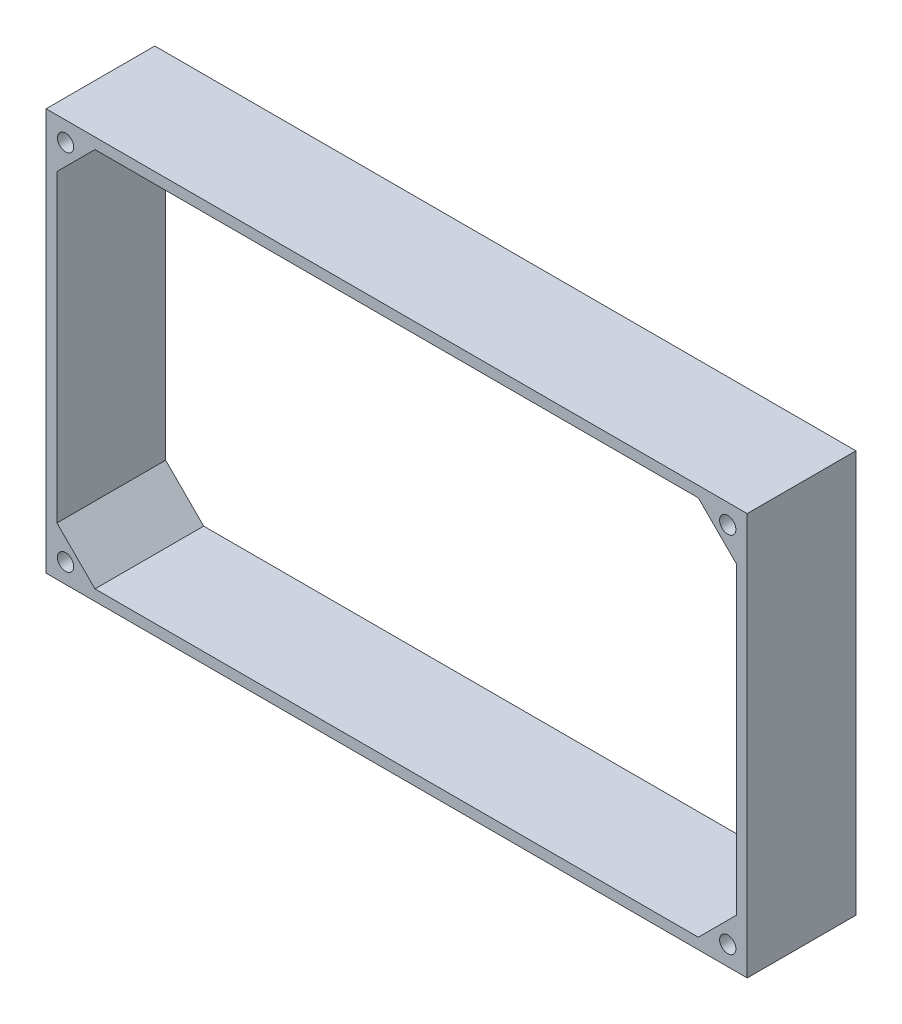
ISO-10303-21;
HEADER;
FILE_DESCRIPTION(('STEP AP214'),'2;1');
FILE_NAME('part.step','',(''),(''),'','','');
FILE_SCHEMA(('AUTOMOTIVE_DESIGN { 1 0 10303 214 1 1 1 1 }'));
ENDSEC;
DATA;
#1=APPLICATION_CONTEXT('core data for automotive mechanical design processes');
#2=APPLICATION_PROTOCOL_DEFINITION('international standard','automotive_design',2000,#1);
#3=PRODUCT_CONTEXT('',#1,'mechanical');
#4=PRODUCT('Part','Part','',(#3));
#5=PRODUCT_RELATED_PRODUCT_CATEGORY('part','',(#4));
#6=PRODUCT_DEFINITION_FORMATION('','',#4);
#7=PRODUCT_DEFINITION_CONTEXT('part definition',#1,'design');
#8=PRODUCT_DEFINITION('design','',#6,#7);
#9=PRODUCT_DEFINITION_SHAPE('','',#8);
#10=(LENGTH_UNIT() NAMED_UNIT(*) SI_UNIT(.MILLI.,.METRE.));
#11=(NAMED_UNIT(*) PLANE_ANGLE_UNIT() SI_UNIT($,.RADIAN.));
#12=(NAMED_UNIT(*) SI_UNIT($,.STERADIAN.) SOLID_ANGLE_UNIT());
#13=UNCERTAINTY_MEASURE_WITH_UNIT(LENGTH_MEASURE(1.E-05),#10,'distance_accuracy_value','');
#14=(GEOMETRIC_REPRESENTATION_CONTEXT(3) GLOBAL_UNCERTAINTY_ASSIGNED_CONTEXT((#13)) GLOBAL_UNIT_ASSIGNED_CONTEXT((#10,
#11,#12)) REPRESENTATION_CONTEXT('',''));
#15=CARTESIAN_POINT('',(0.,0.,0.));
#16=DIRECTION('',(0.,0.,1.));
#17=DIRECTION('',(1.,0.,0.));
#18=AXIS2_PLACEMENT_3D('',#15,#16,#17);
#19=CARTESIAN_POINT('',(0.,74.,40.));
#20=DIRECTION('',(0.,1.,0.));
#21=DIRECTION('',(-1.,0.,0.));
#22=AXIS2_PLACEMENT_3D('',#19,#20,#21);
#23=PLANE('',#22);
#24=DIRECTION('',(1.,0.,0.));
#25=VECTOR('',#24,1.);
#26=CARTESIAN_POINT('',(0.,74.,0.));
#27=LINE('',#26,#25);
#28=CARTESIAN_POINT('',(-129.,74.,0.));
#29=VERTEX_POINT('',#28);
#30=CARTESIAN_POINT('',(129.,74.,0.));
#31=VERTEX_POINT('',#30);
#32=EDGE_CURVE('E196',#29,#31,#27,.T.);
#33=ORIENTED_EDGE('',*,*,#32,.F.);
#34=DIRECTION('',(0.,0.,-1.));
#35=VECTOR('',#34,1.);
#36=CARTESIAN_POINT('',(-129.,74.,40.));
#37=LINE('',#36,#35);
#38=CARTESIAN_POINT('',(-129.,74.,40.));
#39=VERTEX_POINT('',#38);
#40=EDGE_CURVE('E11',#39,#29,#37,.T.);
#41=ORIENTED_EDGE('',*,*,#40,.F.);
#42=DIRECTION('',(1.,0.,0.));
#43=VECTOR('',#42,1.);
#44=CARTESIAN_POINT('',(0.,74.,40.));
#45=LINE('',#44,#43);
#46=CARTESIAN_POINT('',(129.,74.,40.));
#47=VERTEX_POINT('',#46);
#48=EDGE_CURVE('E150',#39,#47,#45,.T.);
#49=ORIENTED_EDGE('',*,*,#48,.T.);
#50=DIRECTION('',(0.,0.,-1.));
#51=VECTOR('',#50,1.);
#52=CARTESIAN_POINT('',(129.,74.,40.));
#53=LINE('',#52,#51);
#54=EDGE_CURVE('E59',#47,#31,#53,.T.);
#55=ORIENTED_EDGE('',*,*,#54,.T.);
#56=EDGE_LOOP('',(#33,#41,#49,#55));
#57=FACE_BOUND('',#56,.T.);
#58=ADVANCED_FACE('F40',(#57),#23,.T.);
#59=CARTESIAN_POINT('',(-129.,0.,40.));
#60=DIRECTION('',(1.,0.,0.));
#61=DIRECTION('',(0.,1.,0.));
#62=AXIS2_PLACEMENT_3D('',#59,#60,#61);
#63=PLANE('',#62);
#64=DIRECTION('',(0.,-1.,0.));
#65=VECTOR('',#64,1.);
#66=CARTESIAN_POINT('',(-129.,0.,0.));
#67=LINE('',#66,#65);
#68=CARTESIAN_POINT('',(-129.,-74.,0.));
#69=VERTEX_POINT('',#68);
#70=EDGE_CURVE('E155',#29,#69,#67,.T.);
#71=ORIENTED_EDGE('',*,*,#70,.T.);
#72=DIRECTION('',(0.,0.,-1.));
#73=VECTOR('',#72,1.);
#74=CARTESIAN_POINT('',(-129.,-74.,40.));
#75=LINE('',#74,#73);
#76=CARTESIAN_POINT('',(-129.,-74.,40.));
#77=VERTEX_POINT('',#76);
#78=EDGE_CURVE('E50',#77,#69,#75,.T.);
#79=ORIENTED_EDGE('',*,*,#78,.F.);
#80=DIRECTION('',(0.,-1.,0.));
#81=VECTOR('',#80,1.);
#82=CARTESIAN_POINT('',(-129.,0.,40.));
#83=LINE('',#82,#81);
#84=EDGE_CURVE('E144',#39,#77,#83,.T.);
#85=ORIENTED_EDGE('',*,*,#84,.F.);
#86=ORIENTED_EDGE('',*,*,#40,.T.);
#87=EDGE_LOOP('',(#71,#79,#85,#86));
#88=FACE_BOUND('',#87,.T.);
#89=ADVANCED_FACE('F153',(#88),#63,.F.);
#90=CARTESIAN_POINT('',(0.,-74.,40.));
#91=DIRECTION('',(0.,1.,0.));
#92=DIRECTION('',(-1.,0.,0.));
#93=AXIS2_PLACEMENT_3D('',#90,#91,#92);
#94=PLANE('',#93);
#95=DIRECTION('',(1.,0.,0.));
#96=VECTOR('',#95,1.);
#97=CARTESIAN_POINT('',(0.,-74.,0.));
#98=LINE('',#97,#96);
#99=CARTESIAN_POINT('',(129.,-74.,0.));
#100=VERTEX_POINT('',#99);
#101=EDGE_CURVE('E193',#69,#100,#98,.T.);
#102=ORIENTED_EDGE('',*,*,#101,.T.);
#103=DIRECTION('',(0.,0.,-1.));
#104=VECTOR('',#103,1.);
#105=CARTESIAN_POINT('',(129.,-74.,40.));
#106=LINE('',#105,#104);
#107=CARTESIAN_POINT('',(129.,-74.,40.));
#108=VERTEX_POINT('',#107);
#109=EDGE_CURVE('E97',#108,#100,#106,.T.);
#110=ORIENTED_EDGE('',*,*,#109,.F.);
#111=DIRECTION('',(1.,0.,0.));
#112=VECTOR('',#111,1.);
#113=CARTESIAN_POINT('',(0.,-74.,40.));
#114=LINE('',#113,#112);
#115=EDGE_CURVE('E136',#77,#108,#114,.T.);
#116=ORIENTED_EDGE('',*,*,#115,.F.);
#117=ORIENTED_EDGE('',*,*,#78,.T.);
#118=EDGE_LOOP('',(#102,#110,#116,#117));
#119=FACE_BOUND('',#118,.T.);
#120=ADVANCED_FACE('F138',(#119),#94,.F.);
#121=CARTESIAN_POINT('',(0.,-70.,40.));
#122=DIRECTION('',(0.,1.,0.));
#123=DIRECTION('',(0.,0.,1.));
#124=AXIS2_PLACEMENT_3D('',#121,#122,#123);
#125=PLANE('',#124);
#126=DIRECTION('',(1.,0.,0.));
#127=VECTOR('',#126,1.);
#128=CARTESIAN_POINT('',(0.,-70.,0.));
#129=LINE('',#128,#127);
#130=CARTESIAN_POINT('',(-111.,-70.,0.));
#131=VERTEX_POINT('',#130);
#132=CARTESIAN_POINT('',(111.,-70.,0.));
#133=VERTEX_POINT('',#132);
#134=EDGE_CURVE('E218',#131,#133,#129,.T.);
#135=ORIENTED_EDGE('',*,*,#134,.F.);
#136=DIRECTION('',(0.,0.,-1.));
#137=VECTOR('',#136,1.);
#138=CARTESIAN_POINT('',(-111.,-70.,40.));
#139=LINE('',#138,#137);
#140=CARTESIAN_POINT('',(-111.,-70.,40.));
#141=VERTEX_POINT('',#140);
#142=EDGE_CURVE('E44',#141,#131,#139,.T.);
#143=ORIENTED_EDGE('',*,*,#142,.F.);
#144=DIRECTION('',(1.,0.,0.));
#145=VECTOR('',#144,1.);
#146=CARTESIAN_POINT('',(0.,-70.,40.));
#147=LINE('',#146,#145);
#148=CARTESIAN_POINT('',(111.,-70.,40.));
#149=VERTEX_POINT('',#148);
#150=EDGE_CURVE('E252',#141,#149,#147,.T.);
#151=ORIENTED_EDGE('',*,*,#150,.T.);
#152=DIRECTION('',(0.,0.,-1.));
#153=VECTOR('',#152,1.);
#154=CARTESIAN_POINT('',(111.,-70.,40.));
#155=LINE('',#154,#153);
#156=EDGE_CURVE('E160',#149,#133,#155,.T.);
#157=ORIENTED_EDGE('',*,*,#156,.T.);
#158=EDGE_LOOP('',(#135,#143,#151,#157));
#159=FACE_BOUND('',#158,.T.);
#160=ADVANCED_FACE('F326',(#159),#125,.T.);
#161=CARTESIAN_POINT('',(-90.5,-90.5,40.));
#162=DIRECTION('',(-0.707106781186548,-0.707106781186548,0.));
#163=DIRECTION('',(0.707106781186548,-0.707106781186548,0.));
#164=AXIS2_PLACEMENT_3D('',#161,#162,#163);
#165=PLANE('',#164);
#166=DIRECTION('',(-0.707106781186548,0.707106781186548,0.));
#167=VECTOR('',#166,1.);
#168=CARTESIAN_POINT('',(-90.5,-90.5,0.));
#169=LINE('',#168,#167);
#170=CARTESIAN_POINT('',(-125.,-56.,0.));
#171=VERTEX_POINT('',#170);
#172=EDGE_CURVE('E216',#131,#171,#169,.T.);
#173=ORIENTED_EDGE('',*,*,#172,.T.);
#174=DIRECTION('',(0.,0.,-1.));
#175=VECTOR('',#174,1.);
#176=CARTESIAN_POINT('',(-125.,-56.,40.));
#177=LINE('',#176,#175);
#178=CARTESIAN_POINT('',(-125.,-56.,40.));
#179=VERTEX_POINT('',#178);
#180=EDGE_CURVE('E174',#179,#171,#177,.T.);
#181=ORIENTED_EDGE('',*,*,#180,.F.);
#182=DIRECTION('',(-0.707106781186548,0.707106781186548,0.));
#183=VECTOR('',#182,1.);
#184=CARTESIAN_POINT('',(-90.5,-90.5,40.));
#185=LINE('',#184,#183);
#186=EDGE_CURVE('E250',#141,#179,#185,.T.);
#187=ORIENTED_EDGE('',*,*,#186,.F.);
#188=ORIENTED_EDGE('',*,*,#142,.T.);
#189=EDGE_LOOP('',(#173,#181,#187,#188));
#190=FACE_BOUND('',#189,.T.);
#191=ADVANCED_FACE('F323',(#190),#165,.F.);
#192=CARTESIAN_POINT('',(-125.,0.,40.));
#193=DIRECTION('',(1.,0.,0.));
#194=DIRECTION('',(0.,0.,-1.));
#195=AXIS2_PLACEMENT_3D('',#192,#193,#194);
#196=PLANE('',#195);
#197=DIRECTION('',(0.,-1.,0.));
#198=VECTOR('',#197,1.);
#199=CARTESIAN_POINT('',(-125.,0.,0.));
#200=LINE('',#199,#198);
#201=CARTESIAN_POINT('',(-125.,56.,0.));
#202=VERTEX_POINT('',#201);
#203=EDGE_CURVE('E213',#202,#171,#200,.T.);
#204=ORIENTED_EDGE('',*,*,#203,.F.);
#205=DIRECTION('',(0.,0.,-1.));
#206=VECTOR('',#205,1.);
#207=CARTESIAN_POINT('',(-125.,56.,40.));
#208=LINE('',#207,#206);
#209=CARTESIAN_POINT('',(-125.,56.,40.));
#210=VERTEX_POINT('',#209);
#211=EDGE_CURVE('E173',#210,#202,#208,.T.);
#212=ORIENTED_EDGE('',*,*,#211,.F.);
#213=DIRECTION('',(0.,-1.,0.));
#214=VECTOR('',#213,1.);
#215=CARTESIAN_POINT('',(-125.,0.,40.));
#216=LINE('',#215,#214);
#217=EDGE_CURVE('E248',#210,#179,#216,.T.);
#218=ORIENTED_EDGE('',*,*,#217,.T.);
#219=ORIENTED_EDGE('',*,*,#180,.T.);
#220=EDGE_LOOP('',(#204,#212,#218,#219));
#221=FACE_BOUND('',#220,.T.);
#222=ADVANCED_FACE('F319',(#221),#196,.T.);
#223=CARTESIAN_POINT('',(-90.5,90.5,40.));
#224=DIRECTION('',(0.707106781186548,-0.707106781186548,0.));
#225=DIRECTION('',(0.707106781186548,0.707106781186548,0.));
#226=AXIS2_PLACEMENT_3D('',#223,#224,#225);
#227=PLANE('',#226);
#228=DIRECTION('',(-0.707106781186548,-0.707106781186548,0.));
#229=VECTOR('',#228,1.);
#230=CARTESIAN_POINT('',(-90.5,90.5,0.));
#231=LINE('',#230,#229);
#232=CARTESIAN_POINT('',(-111.,70.,0.));
#233=VERTEX_POINT('',#232);
#234=EDGE_CURVE('E210',#233,#202,#231,.T.);
#235=ORIENTED_EDGE('',*,*,#234,.F.);
#236=DIRECTION('',(0.,0.,-1.));
#237=VECTOR('',#236,1.);
#238=CARTESIAN_POINT('',(-111.,70.,40.));
#239=LINE('',#238,#237);
#240=CARTESIAN_POINT('',(-111.,70.,40.));
#241=VERTEX_POINT('',#240);
#242=EDGE_CURVE('E171',#241,#233,#239,.T.);
#243=ORIENTED_EDGE('',*,*,#242,.F.);
#244=DIRECTION('',(-0.707106781186548,-0.707106781186548,0.));
#245=VECTOR('',#244,1.);
#246=CARTESIAN_POINT('',(-90.5,90.5,40.));
#247=LINE('',#246,#245);
#248=EDGE_CURVE('E245',#241,#210,#247,.T.);
#249=ORIENTED_EDGE('',*,*,#248,.T.);
#250=ORIENTED_EDGE('',*,*,#211,.T.);
#251=EDGE_LOOP('',(#235,#243,#249,#250));
#252=FACE_BOUND('',#251,.T.);
#253=ADVANCED_FACE('F315',(#252),#227,.T.);
#254=CARTESIAN_POINT('',(0.,70.,40.));
#255=DIRECTION('',(0.,1.,0.));
#256=DIRECTION('',(0.,0.,1.));
#257=AXIS2_PLACEMENT_3D('',#254,#255,#256);
#258=PLANE('',#257);
#259=DIRECTION('',(1.,0.,0.));
#260=VECTOR('',#259,1.);
#261=CARTESIAN_POINT('',(0.,70.,0.));
#262=LINE('',#261,#260);
#263=CARTESIAN_POINT('',(111.,70.,0.));
#264=VERTEX_POINT('',#263);
#265=EDGE_CURVE('E207',#233,#264,#262,.T.);
#266=ORIENTED_EDGE('',*,*,#265,.T.);
#267=DIRECTION('',(0.,0.,-1.));
#268=VECTOR('',#267,1.);
#269=CARTESIAN_POINT('',(111.,70.,40.));
#270=LINE('',#269,#268);
#271=CARTESIAN_POINT('',(111.,70.,40.));
#272=VERTEX_POINT('',#271);
#273=EDGE_CURVE('E168',#272,#264,#270,.T.);
#274=ORIENTED_EDGE('',*,*,#273,.F.);
#275=DIRECTION('',(1.,0.,0.));
#276=VECTOR('',#275,1.);
#277=CARTESIAN_POINT('',(0.,70.,40.));
#278=LINE('',#277,#276);
#279=EDGE_CURVE('E242',#241,#272,#278,.T.);
#280=ORIENTED_EDGE('',*,*,#279,.F.);
#281=ORIENTED_EDGE('',*,*,#242,.T.);
#282=EDGE_LOOP('',(#266,#274,#280,#281));
#283=FACE_BOUND('',#282,.T.);
#284=ADVANCED_FACE('F311',(#283),#258,.F.);
#285=CARTESIAN_POINT('',(90.5,90.5,40.));
#286=DIRECTION('',(0.707106781186548,0.707106781186548,0.));
#287=DIRECTION('',(-0.707106781186548,0.707106781186548,0.));
#288=AXIS2_PLACEMENT_3D('',#285,#286,#287);
#289=PLANE('',#288);
#290=DIRECTION('',(0.707106781186548,-0.707106781186548,0.));
#291=VECTOR('',#290,1.);
#292=CARTESIAN_POINT('',(90.5,90.5,0.));
#293=LINE('',#292,#291);
#294=CARTESIAN_POINT('',(125.,56.,0.));
#295=VERTEX_POINT('',#294);
#296=EDGE_CURVE('E204',#264,#295,#293,.T.);
#297=ORIENTED_EDGE('',*,*,#296,.T.);
#298=DIRECTION('',(0.,0.,-1.));
#299=VECTOR('',#298,1.);
#300=CARTESIAN_POINT('',(125.,56.,40.));
#301=LINE('',#300,#299);
#302=CARTESIAN_POINT('',(125.,56.,40.));
#303=VERTEX_POINT('',#302);
#304=EDGE_CURVE('E165',#303,#295,#301,.T.);
#305=ORIENTED_EDGE('',*,*,#304,.F.);
#306=DIRECTION('',(0.707106781186548,-0.707106781186548,0.));
#307=VECTOR('',#306,1.);
#308=CARTESIAN_POINT('',(90.5,90.5,40.));
#309=LINE('',#308,#307);
#310=EDGE_CURVE('E239',#272,#303,#309,.T.);
#311=ORIENTED_EDGE('',*,*,#310,.F.);
#312=ORIENTED_EDGE('',*,*,#273,.T.);
#313=EDGE_LOOP('',(#297,#305,#311,#312));
#314=FACE_BOUND('',#313,.T.);
#315=ADVANCED_FACE('F307',(#314),#289,.F.);
#316=CARTESIAN_POINT('',(125.,0.,40.));
#317=DIRECTION('',(1.,0.,0.));
#318=DIRECTION('',(0.,0.,-1.));
#319=AXIS2_PLACEMENT_3D('',#316,#317,#318);
#320=PLANE('',#319);
#321=DIRECTION('',(0.,-1.,0.));
#322=VECTOR('',#321,1.);
#323=CARTESIAN_POINT('',(125.,0.,0.));
#324=LINE('',#323,#322);
#325=CARTESIAN_POINT('',(125.,-56.,0.));
#326=VERTEX_POINT('',#325);
#327=EDGE_CURVE('E201',#295,#326,#324,.T.);
#328=ORIENTED_EDGE('',*,*,#327,.T.);
#329=DIRECTION('',(0.,0.,-1.));
#330=VECTOR('',#329,1.);
#331=CARTESIAN_POINT('',(125.,-56.,40.));
#332=LINE('',#331,#330);
#333=CARTESIAN_POINT('',(125.,-56.,40.));
#334=VERTEX_POINT('',#333);
#335=EDGE_CURVE('E162',#334,#326,#332,.T.);
#336=ORIENTED_EDGE('',*,*,#335,.F.);
#337=DIRECTION('',(0.,-1.,0.));
#338=VECTOR('',#337,1.);
#339=CARTESIAN_POINT('',(125.,0.,40.));
#340=LINE('',#339,#338);
#341=EDGE_CURVE('E237',#303,#334,#340,.T.);
#342=ORIENTED_EDGE('',*,*,#341,.F.);
#343=ORIENTED_EDGE('',*,*,#304,.T.);
#344=EDGE_LOOP('',(#328,#336,#342,#343));
#345=FACE_BOUND('',#344,.T.);
#346=ADVANCED_FACE('F303',(#345),#320,.F.);
#347=CARTESIAN_POINT('',(121.832077187261,-66.8320771872609,40.));
#348=DIRECTION('',(0.,0.,-1.));
#349=DIRECTION('',(-1.,0.,0.));
#350=AXIS2_PLACEMENT_3D('',#347,#348,#349);
#351=CYLINDRICAL_SURFACE('',#350,3.00000000000001);
#352=CARTESIAN_POINT('',(121.832077187261,-66.8320771872609,40.));
#353=DIRECTION('',(0.,0.,1.));
#354=DIRECTION('',(1.,0.,0.));
#355=AXIS2_PLACEMENT_3D('',#352,#353,#354);
#356=CIRCLE('',#355,3.00000000000001);
#357=CARTESIAN_POINT('',(124.832077187261,-66.8320771872609,40.));
#358=VERTEX_POINT('',#357);
#359=EDGE_CURVE('E229',#358,#358,#356,.T.);
#360=ORIENTED_EDGE('',*,*,#359,.T.);
#361=EDGE_LOOP('',(#360));
#362=FACE_BOUND('',#361,.T.);
#363=CARTESIAN_POINT('',(121.832077187261,-66.8320771872609,0.));
#364=DIRECTION('',(0.,0.,1.));
#365=DIRECTION('',(1.,0.,0.));
#366=AXIS2_PLACEMENT_3D('',#363,#364,#365);
#367=CIRCLE('',#366,3.00000000000001);
#368=CARTESIAN_POINT('',(124.832077187261,-66.8320771872609,0.));
#369=VERTEX_POINT('',#368);
#370=EDGE_CURVE('E187',#369,#369,#367,.T.);
#371=ORIENTED_EDGE('',*,*,#370,.F.);
#372=EDGE_LOOP('',(#371));
#373=FACE_BOUND('',#372,.T.);
#374=ADVANCED_FACE('F306',(#362,#373),#351,.F.);
#375=CARTESIAN_POINT('',(129.,0.,40.));
#376=DIRECTION('',(1.,0.,0.));
#377=DIRECTION('',(0.,1.,0.));
#378=AXIS2_PLACEMENT_3D('',#375,#376,#377);
#379=PLANE('',#378);
#380=DIRECTION('',(0.,-1.,0.));
#381=VECTOR('',#380,1.);
#382=CARTESIAN_POINT('',(129.,0.,0.));
#383=LINE('',#382,#381);
#384=EDGE_CURVE('E190',#31,#100,#383,.T.);
#385=ORIENTED_EDGE('',*,*,#384,.F.);
#386=ORIENTED_EDGE('',*,*,#54,.F.);
#387=DIRECTION('',(0.,-1.,0.));
#388=VECTOR('',#387,1.);
#389=CARTESIAN_POINT('',(129.,0.,40.));
#390=LINE('',#389,#388);
#391=EDGE_CURVE('E143',#47,#108,#390,.T.);
#392=ORIENTED_EDGE('',*,*,#391,.T.);
#393=ORIENTED_EDGE('',*,*,#109,.T.);
#394=EDGE_LOOP('',(#385,#386,#392,#393));
#395=FACE_BOUND('',#394,.T.);
#396=ADVANCED_FACE('F301',(#395),#379,.T.);
#397=CARTESIAN_POINT('',(90.5,-90.5,40.));
#398=DIRECTION('',(-0.707106781186548,0.707106781186548,0.));
#399=DIRECTION('',(-0.707106781186548,-0.707106781186548,0.));
#400=AXIS2_PLACEMENT_3D('',#397,#398,#399);
#401=PLANE('',#400);
#402=DIRECTION('',(0.707106781186548,0.707106781186548,0.));
#403=VECTOR('',#402,1.);
#404=CARTESIAN_POINT('',(90.5,-90.5,0.));
#405=LINE('',#404,#403);
#406=EDGE_CURVE('E198',#133,#326,#405,.T.);
#407=ORIENTED_EDGE('',*,*,#406,.F.);
#408=ORIENTED_EDGE('',*,*,#156,.F.);
#409=DIRECTION('',(0.707106781186548,0.707106781186548,0.));
#410=VECTOR('',#409,1.);
#411=CARTESIAN_POINT('',(90.5,-90.5,40.));
#412=LINE('',#411,#410);
#413=EDGE_CURVE('E234',#149,#334,#412,.T.);
#414=ORIENTED_EDGE('',*,*,#413,.T.);
#415=ORIENTED_EDGE('',*,*,#335,.T.);
#416=EDGE_LOOP('',(#407,#408,#414,#415));
#417=FACE_BOUND('',#416,.T.);
#418=ADVANCED_FACE('F298',(#417),#401,.T.);
#419=CARTESIAN_POINT('',(-121.832077187261,66.8320771872609,40.));
#420=DIRECTION('',(0.,0.,-1.));
#421=DIRECTION('',(-1.,0.,0.));
#422=AXIS2_PLACEMENT_3D('',#419,#420,#421);
#423=CYLINDRICAL_SURFACE('',#422,3.00000000000001);
#424=CARTESIAN_POINT('',(-121.832077187261,66.8320771872609,40.));
#425=DIRECTION('',(0.,0.,1.));
#426=DIRECTION('',(1.,0.,0.));
#427=AXIS2_PLACEMENT_3D('',#424,#425,#426);
#428=CIRCLE('',#427,3.00000000000001);
#429=CARTESIAN_POINT('',(-118.832077187261,66.8320771872609,40.));
#430=VERTEX_POINT('',#429);
#431=EDGE_CURVE('E254',#430,#430,#428,.T.);
#432=ORIENTED_EDGE('',*,*,#431,.T.);
#433=EDGE_LOOP('',(#432));
#434=FACE_BOUND('',#433,.T.);
#435=CARTESIAN_POINT('',(-121.832077187261,66.8320771872609,0.));
#436=DIRECTION('',(0.,0.,1.));
#437=DIRECTION('',(1.,0.,0.));
#438=AXIS2_PLACEMENT_3D('',#435,#436,#437);
#439=CIRCLE('',#438,3.00000000000001);
#440=CARTESIAN_POINT('',(-118.832077187261,66.8320771872609,0.));
#441=VERTEX_POINT('',#440);
#442=EDGE_CURVE('E221',#441,#441,#439,.T.);
#443=ORIENTED_EDGE('',*,*,#442,.F.);
#444=EDGE_LOOP('',(#443));
#445=FACE_BOUND('',#444,.T.);
#446=ADVANCED_FACE('F265',(#434,#445),#423,.F.);
#447=CARTESIAN_POINT('',(-121.832077187261,-66.8320771872609,40.));
#448=DIRECTION('',(0.,0.,-1.));
#449=DIRECTION('',(-1.,0.,0.));
#450=AXIS2_PLACEMENT_3D('',#447,#448,#449);
#451=CYLINDRICAL_SURFACE('',#450,3.00000000000001);
#452=CARTESIAN_POINT('',(-121.832077187261,-66.8320771872609,40.));
#453=DIRECTION('',(0.,0.,1.));
#454=DIRECTION('',(1.,0.,0.));
#455=AXIS2_PLACEMENT_3D('',#452,#453,#454);
#456=CIRCLE('',#455,3.00000000000001);
#457=CARTESIAN_POINT('',(-118.832077187261,-66.8320771872609,40.));
#458=VERTEX_POINT('',#457);
#459=EDGE_CURVE('E186',#458,#458,#456,.F.);
#460=ORIENTED_EDGE('',*,*,#459,.F.);
#461=EDGE_LOOP('',(#460));
#462=FACE_BOUND('',#461,.T.);
#463=CARTESIAN_POINT('',(-121.832077187261,-66.8320771872609,0.));
#464=DIRECTION('',(0.,0.,1.));
#465=DIRECTION('',(1.,0.,0.));
#466=AXIS2_PLACEMENT_3D('',#463,#464,#465);
#467=CIRCLE('',#466,3.00000000000001);
#468=CARTESIAN_POINT('',(-118.832077187261,-66.8320771872609,0.));
#469=VERTEX_POINT('',#468);
#470=EDGE_CURVE('E224',#469,#469,#467,.F.);
#471=ORIENTED_EDGE('',*,*,#470,.T.);
#472=EDGE_LOOP('',(#471));
#473=FACE_BOUND('',#472,.T.);
#474=ADVANCED_FACE('F42',(#462,#473),#451,.F.);
#475=CARTESIAN_POINT('',(121.832077187261,66.8320771872609,40.));
#476=DIRECTION('',(0.,0.,-1.));
#477=DIRECTION('',(-1.,0.,0.));
#478=AXIS2_PLACEMENT_3D('',#475,#476,#477);
#479=CYLINDRICAL_SURFACE('',#478,3.00000000000001);
#480=CARTESIAN_POINT('',(121.832077187261,66.8320771872609,40.));
#481=DIRECTION('',(0.,0.,1.));
#482=DIRECTION('',(1.,0.,0.));
#483=AXIS2_PLACEMENT_3D('',#480,#481,#482);
#484=CIRCLE('',#483,3.00000000000001);
#485=CARTESIAN_POINT('',(124.832077187261,66.8320771872609,40.));
#486=VERTEX_POINT('',#485);
#487=EDGE_CURVE('E163',#486,#486,#484,.F.);
#488=ORIENTED_EDGE('',*,*,#487,.F.);
#489=EDGE_LOOP('',(#488));
#490=FACE_BOUND('',#489,.T.);
#491=CARTESIAN_POINT('',(121.832077187261,66.8320771872609,0.));
#492=DIRECTION('',(0.,0.,1.));
#493=DIRECTION('',(1.,0.,0.));
#494=AXIS2_PLACEMENT_3D('',#491,#492,#493);
#495=CIRCLE('',#494,3.00000000000001);
#496=CARTESIAN_POINT('',(124.832077187261,66.8320771872609,0.));
#497=VERTEX_POINT('',#496);
#498=EDGE_CURVE('E183',#497,#497,#495,.F.);
#499=ORIENTED_EDGE('',*,*,#498,.T.);
#500=EDGE_LOOP('',(#499));
#501=FACE_BOUND('',#500,.T.);
#502=ADVANCED_FACE('F264',(#490,#501),#479,.F.);
#503=CARTESIAN_POINT('',(0.,0.,40.));
#504=DIRECTION('',(0.,0.,1.));
#505=DIRECTION('',(1.,0.,0.));
#506=AXIS2_PLACEMENT_3D('',#503,#504,#505);
#507=PLANE('',#506);
#508=ORIENTED_EDGE('',*,*,#459,.T.);
#509=EDGE_LOOP('',(#508));
#510=FACE_BOUND('',#509,.T.);
#511=ORIENTED_EDGE('',*,*,#431,.F.);
#512=EDGE_LOOP('',(#511));
#513=FACE_BOUND('',#512,.T.);
#514=ORIENTED_EDGE('',*,*,#150,.F.);
#515=ORIENTED_EDGE('',*,*,#186,.T.);
#516=ORIENTED_EDGE('',*,*,#217,.F.);
#517=ORIENTED_EDGE('',*,*,#248,.F.);
#518=ORIENTED_EDGE('',*,*,#279,.T.);
#519=ORIENTED_EDGE('',*,*,#310,.T.);
#520=ORIENTED_EDGE('',*,*,#341,.T.);
#521=ORIENTED_EDGE('',*,*,#413,.F.);
#522=EDGE_LOOP('',(#514,#515,#516,#517,#518,#519,#520,#521));
#523=FACE_BOUND('',#522,.T.);
#524=ORIENTED_EDGE('',*,*,#48,.F.);
#525=ORIENTED_EDGE('',*,*,#84,.T.);
#526=ORIENTED_EDGE('',*,*,#115,.T.);
#527=ORIENTED_EDGE('',*,*,#391,.F.);
#528=EDGE_LOOP('',(#524,#525,#526,#527));
#529=FACE_BOUND('',#528,.T.);
#530=ORIENTED_EDGE('',*,*,#359,.F.);
#531=EDGE_LOOP('',(#530));
#532=FACE_BOUND('',#531,.T.);
#533=ORIENTED_EDGE('',*,*,#487,.T.);
#534=EDGE_LOOP('',(#533));
#535=FACE_BOUND('',#534,.T.);
#536=ADVANCED_FACE('F148',(#510,#513,#523,#529,#532,#535),#507,.T.);
#537=CARTESIAN_POINT('',(0.,0.,0.));
#538=DIRECTION('',(0.,0.,1.));
#539=DIRECTION('',(1.,0.,0.));
#540=AXIS2_PLACEMENT_3D('',#537,#538,#539);
#541=PLANE('',#540);
#542=ORIENTED_EDGE('',*,*,#470,.F.);
#543=EDGE_LOOP('',(#542));
#544=FACE_BOUND('',#543,.T.);
#545=ORIENTED_EDGE('',*,*,#442,.T.);
#546=EDGE_LOOP('',(#545));
#547=FACE_BOUND('',#546,.T.);
#548=ORIENTED_EDGE('',*,*,#134,.T.);
#549=ORIENTED_EDGE('',*,*,#406,.T.);
#550=ORIENTED_EDGE('',*,*,#327,.F.);
#551=ORIENTED_EDGE('',*,*,#296,.F.);
#552=ORIENTED_EDGE('',*,*,#265,.F.);
#553=ORIENTED_EDGE('',*,*,#234,.T.);
#554=ORIENTED_EDGE('',*,*,#203,.T.);
#555=ORIENTED_EDGE('',*,*,#172,.F.);
#556=EDGE_LOOP('',(#548,#549,#550,#551,#552,#553,#554,#555));
#557=FACE_BOUND('',#556,.T.);
#558=ORIENTED_EDGE('',*,*,#32,.T.);
#559=ORIENTED_EDGE('',*,*,#384,.T.);
#560=ORIENTED_EDGE('',*,*,#101,.F.);
#561=ORIENTED_EDGE('',*,*,#70,.F.);
#562=EDGE_LOOP('',(#558,#559,#560,#561));
#563=FACE_BOUND('',#562,.T.);
#564=ORIENTED_EDGE('',*,*,#370,.T.);
#565=EDGE_LOOP('',(#564));
#566=FACE_BOUND('',#565,.T.);
#567=ORIENTED_EDGE('',*,*,#498,.F.);
#568=EDGE_LOOP('',(#567));
#569=FACE_BOUND('',#568,.T.);
#570=ADVANCED_FACE('F268',(#544,#547,#557,#563,#566,#569),#541,.F.);
#571=CLOSED_SHELL('',(#58,#89,#120,#160,#191,#222,#253,#284,#315,#346,#374,#396,#418,#446,#474,
#502,#536,#570));
#572=MANIFOLD_SOLID_BREP('B2',#571);
#573=ADVANCED_BREP_SHAPE_REPRESENTATION('',(#18,#572),#14);
#574=SHAPE_DEFINITION_REPRESENTATION(#9,#573);
ENDSEC;
END-ISO-10303-21;
